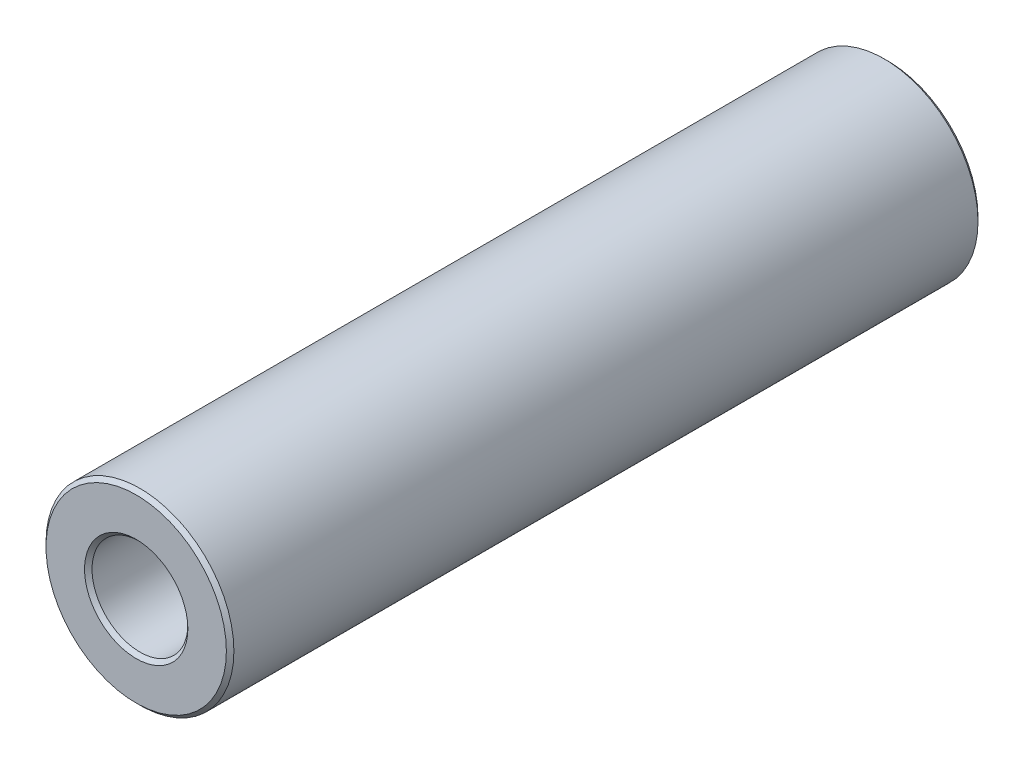
ISO-10303-21;
HEADER;
FILE_DESCRIPTION(('STEP AP214'),'2;1');
FILE_NAME('part.step','',(''),(''),'','','');
FILE_SCHEMA(('AUTOMOTIVE_DESIGN { 1 0 10303 214 1 1 1 1 }'));
ENDSEC;
DATA;
#1=APPLICATION_CONTEXT('core data for automotive mechanical design processes');
#2=APPLICATION_PROTOCOL_DEFINITION('international standard','automotive_design',2000,#1);
#3=PRODUCT_CONTEXT('',#1,'mechanical');
#4=PRODUCT('Part','Part','',(#3));
#5=PRODUCT_RELATED_PRODUCT_CATEGORY('part','',(#4));
#6=PRODUCT_DEFINITION_FORMATION('','',#4);
#7=PRODUCT_DEFINITION_CONTEXT('part definition',#1,'design');
#8=PRODUCT_DEFINITION('design','',#6,#7);
#9=PRODUCT_DEFINITION_SHAPE('','',#8);
#10=(LENGTH_UNIT() NAMED_UNIT(*) SI_UNIT(.MILLI.,.METRE.));
#11=(NAMED_UNIT(*) PLANE_ANGLE_UNIT() SI_UNIT($,.RADIAN.));
#12=(NAMED_UNIT(*) SI_UNIT($,.STERADIAN.) SOLID_ANGLE_UNIT());
#13=UNCERTAINTY_MEASURE_WITH_UNIT(LENGTH_MEASURE(1.E-05),#10,'distance_accuracy_value','');
#14=(GEOMETRIC_REPRESENTATION_CONTEXT(3) GLOBAL_UNCERTAINTY_ASSIGNED_CONTEXT((#13)) GLOBAL_UNIT_ASSIGNED_CONTEXT((#10,
#11,#12)) REPRESENTATION_CONTEXT('',''));
#15=CARTESIAN_POINT('',(0.,0.,0.));
#16=DIRECTION('',(0.,0.,1.));
#17=DIRECTION('',(1.,0.,0.));
#18=AXIS2_PLACEMENT_3D('',#15,#16,#17);
#19=CARTESIAN_POINT('',(0.,0.,40.));
#20=DIRECTION('',(0.,0.,1.));
#21=DIRECTION('',(1.,0.,0.));
#22=AXIS2_PLACEMENT_3D('',#19,#20,#21);
#23=PLANE('',#22);
#24=CARTESIAN_POINT('',(0.,0.,40.));
#25=DIRECTION('',(0.,0.,1.));
#26=DIRECTION('',(1.,0.,0.));
#27=AXIS2_PLACEMENT_3D('',#24,#25,#26);
#28=CIRCLE('',#27,2.75);
#29=CARTESIAN_POINT('',(2.75,0.,40.));
#30=VERTEX_POINT('',#29);
#31=EDGE_CURVE('E10',#30,#30,#28,.F.);
#32=ORIENTED_EDGE('',*,*,#31,.T.);
#33=EDGE_LOOP('',(#32));
#34=FACE_BOUND('',#33,.T.);
#35=CARTESIAN_POINT('',(0.,0.,40.));
#36=DIRECTION('',(0.,0.,1.));
#37=DIRECTION('',(1.,0.,0.));
#38=AXIS2_PLACEMENT_3D('',#35,#36,#37);
#39=CIRCLE('',#38,4.8);
#40=CARTESIAN_POINT('',(4.8,0.,40.));
#41=VERTEX_POINT('',#40);
#42=EDGE_CURVE('E39',#41,#41,#39,.T.);
#43=ORIENTED_EDGE('',*,*,#42,.T.);
#44=EDGE_LOOP('',(#43));
#45=FACE_BOUND('',#44,.T.);
#46=ADVANCED_FACE('F32',(#34,#45),#23,.T.);
#47=CARTESIAN_POINT('',(0.,0.,0.));
#48=DIRECTION('',(0.,0.,1.));
#49=DIRECTION('',(1.,0.,0.));
#50=AXIS2_PLACEMENT_3D('',#47,#48,#49);
#51=PLANE('',#50);
#52=CARTESIAN_POINT('',(0.,0.,0.));
#53=DIRECTION('',(0.,0.,1.));
#54=DIRECTION('',(1.,0.,0.));
#55=AXIS2_PLACEMENT_3D('',#52,#53,#54);
#56=CIRCLE('',#55,4.8);
#57=CARTESIAN_POINT('',(4.8,0.,0.));
#58=VERTEX_POINT('',#57);
#59=EDGE_CURVE('E52',#58,#58,#56,.F.);
#60=ORIENTED_EDGE('',*,*,#59,.T.);
#61=EDGE_LOOP('',(#60));
#62=FACE_BOUND('',#61,.T.);
#63=CARTESIAN_POINT('',(0.,0.,0.));
#64=DIRECTION('',(0.,0.,1.));
#65=DIRECTION('',(1.,0.,0.));
#66=AXIS2_PLACEMENT_3D('',#63,#64,#65);
#67=CIRCLE('',#66,2.75);
#68=CARTESIAN_POINT('',(2.75,0.,0.));
#69=VERTEX_POINT('',#68);
#70=EDGE_CURVE('E55',#69,#69,#67,.T.);
#71=ORIENTED_EDGE('',*,*,#70,.T.);
#72=EDGE_LOOP('',(#71));
#73=FACE_BOUND('',#72,.T.);
#74=ADVANCED_FACE('F76',(#62,#73),#51,.F.);
#75=CARTESIAN_POINT('',(0.,0.,40.));
#76=DIRECTION('',(0.,0.,-1.));
#77=DIRECTION('',(-1.,0.,0.));
#78=AXIS2_PLACEMENT_3D('',#75,#76,#77);
#79=CYLINDRICAL_SURFACE('',#78,5.);
#80=CARTESIAN_POINT('',(0.,0.,0.200000000000006));
#81=DIRECTION('',(0.,0.,1.));
#82=DIRECTION('',(1.,0.,0.));
#83=AXIS2_PLACEMENT_3D('',#80,#81,#82);
#84=CIRCLE('',#83,5.);
#85=CARTESIAN_POINT('',(5.,0.,0.200000000000006));
#86=VERTEX_POINT('',#85);
#87=EDGE_CURVE('E58',#86,#86,#84,.T.);
#88=ORIENTED_EDGE('',*,*,#87,.T.);
#89=EDGE_LOOP('',(#88));
#90=FACE_BOUND('',#89,.T.);
#91=CARTESIAN_POINT('',(0.,0.,39.8));
#92=DIRECTION('',(0.,0.,1.));
#93=DIRECTION('',(1.,0.,0.));
#94=AXIS2_PLACEMENT_3D('',#91,#92,#93);
#95=CIRCLE('',#94,5.);
#96=CARTESIAN_POINT('',(5.,0.,39.8));
#97=VERTEX_POINT('',#96);
#98=EDGE_CURVE('E61',#97,#97,#95,.F.);
#99=ORIENTED_EDGE('',*,*,#98,.T.);
#100=EDGE_LOOP('',(#99));
#101=FACE_BOUND('',#100,.T.);
#102=ADVANCED_FACE('F65',(#90,#101),#79,.T.);
#103=CARTESIAN_POINT('',(0.,0.,40.));
#104=DIRECTION('',(0.,0.,-1.));
#105=DIRECTION('',(-1.,0.,0.));
#106=AXIS2_PLACEMENT_3D('',#103,#104,#105);
#107=CYLINDRICAL_SURFACE('',#106,2.55);
#108=CARTESIAN_POINT('',(0.,0.,0.199999999999999));
#109=DIRECTION('',(0.,0.,1.));
#110=DIRECTION('',(1.,0.,0.));
#111=AXIS2_PLACEMENT_3D('',#108,#109,#110);
#112=CIRCLE('',#111,2.55);
#113=CARTESIAN_POINT('',(2.55,0.,0.199999999999999));
#114=VERTEX_POINT('',#113);
#115=EDGE_CURVE('E43',#114,#114,#112,.F.);
#116=ORIENTED_EDGE('',*,*,#115,.T.);
#117=EDGE_LOOP('',(#116));
#118=FACE_BOUND('',#117,.T.);
#119=CARTESIAN_POINT('',(0.,0.,39.8));
#120=DIRECTION('',(0.,0.,1.));
#121=DIRECTION('',(1.,0.,0.));
#122=AXIS2_PLACEMENT_3D('',#119,#120,#121);
#123=CIRCLE('',#122,2.55);
#124=CARTESIAN_POINT('',(2.55,0.,39.8));
#125=VERTEX_POINT('',#124);
#126=EDGE_CURVE('E47',#125,#125,#123,.T.);
#127=ORIENTED_EDGE('',*,*,#126,.T.);
#128=EDGE_LOOP('',(#127));
#129=FACE_BOUND('',#128,.T.);
#130=ADVANCED_FACE('F84',(#118,#129),#107,.F.);
#131=CARTESIAN_POINT('',(0.,0.,0.200000000000006));
#132=DIRECTION('',(0.,0.,1.));
#133=DIRECTION('',(1.,0.,0.));
#134=AXIS2_PLACEMENT_3D('',#131,#132,#133);
#135=CONICAL_SURFACE('',#134,5.,0.785398163397446);
#136=ORIENTED_EDGE('',*,*,#59,.F.);
#137=EDGE_LOOP('',(#136));
#138=FACE_BOUND('',#137,.T.);
#139=ORIENTED_EDGE('',*,*,#87,.F.);
#140=EDGE_LOOP('',(#139));
#141=FACE_BOUND('',#140,.T.);
#142=ADVANCED_FACE('F89',(#138,#141),#135,.T.);
#143=CARTESIAN_POINT('',(0.,0.,0.));
#144=DIRECTION('',(0.,0.,-1.));
#145=DIRECTION('',(-1.,0.,0.));
#146=AXIS2_PLACEMENT_3D('',#143,#144,#145);
#147=CONICAL_SURFACE('',#146,2.75,0.785398163397441);
#148=ORIENTED_EDGE('',*,*,#115,.F.);
#149=EDGE_LOOP('',(#148));
#150=FACE_BOUND('',#149,.T.);
#151=ORIENTED_EDGE('',*,*,#70,.F.);
#152=EDGE_LOOP('',(#151));
#153=FACE_BOUND('',#152,.T.);
#154=ADVANCED_FACE('F73',(#150,#153),#147,.F.);
#155=CARTESIAN_POINT('',(0.,0.,39.8));
#156=DIRECTION('',(0.,0.,1.));
#157=DIRECTION('',(1.,0.,0.));
#158=AXIS2_PLACEMENT_3D('',#155,#156,#157);
#159=CONICAL_SURFACE('',#158,2.55,0.785398163397458);
#160=ORIENTED_EDGE('',*,*,#31,.F.);
#161=EDGE_LOOP('',(#160));
#162=FACE_BOUND('',#161,.T.);
#163=ORIENTED_EDGE('',*,*,#126,.F.);
#164=EDGE_LOOP('',(#163));
#165=FACE_BOUND('',#164,.T.);
#166=ADVANCED_FACE('F69',(#162,#165),#159,.F.);
#167=CARTESIAN_POINT('',(0.,0.,40.));
#168=DIRECTION('',(0.,0.,-1.));
#169=DIRECTION('',(-1.,0.,0.));
#170=AXIS2_PLACEMENT_3D('',#167,#168,#169);
#171=CONICAL_SURFACE('',#170,4.8,0.785398163397446);
#172=ORIENTED_EDGE('',*,*,#98,.F.);
#173=EDGE_LOOP('',(#172));
#174=FACE_BOUND('',#173,.T.);
#175=ORIENTED_EDGE('',*,*,#42,.F.);
#176=EDGE_LOOP('',(#175));
#177=FACE_BOUND('',#176,.T.);
#178=ADVANCED_FACE('F34',(#174,#177),#171,.T.);
#179=CLOSED_SHELL('',(#46,#74,#102,#130,#142,#154,#166,#178));
#180=MANIFOLD_SOLID_BREP('B2',#179);
#181=ADVANCED_BREP_SHAPE_REPRESENTATION('',(#18,#180),#14);
#182=SHAPE_DEFINITION_REPRESENTATION(#9,#181);
ENDSEC;
END-ISO-10303-21;
